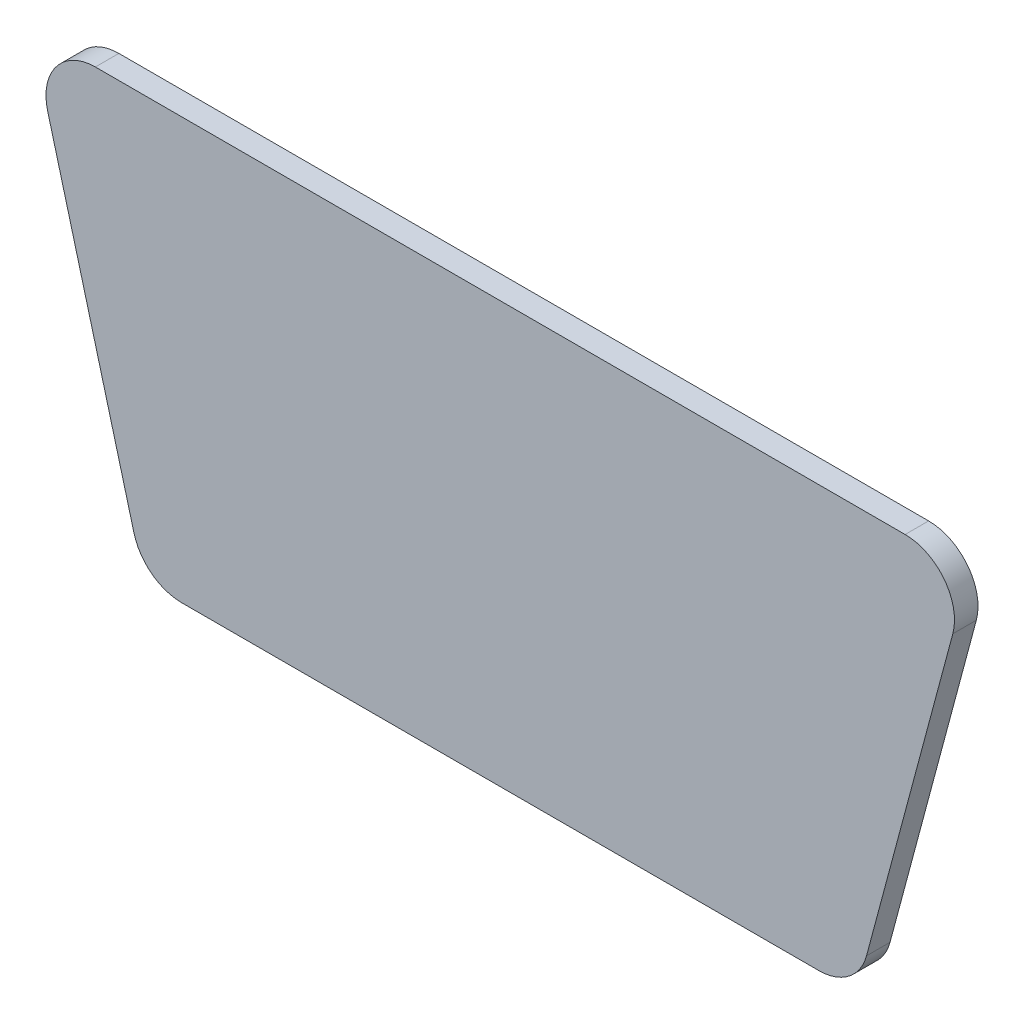
ISO-10303-21;
HEADER;
FILE_DESCRIPTION(('STEP AP214'),'2;1');
FILE_NAME('part.step','',(''),(''),'','','');
FILE_SCHEMA(('AUTOMOTIVE_DESIGN { 1 0 10303 214 1 1 1 1 }'));
ENDSEC;
DATA;
#1=APPLICATION_CONTEXT('core data for automotive mechanical design processes');
#2=APPLICATION_PROTOCOL_DEFINITION('international standard','automotive_design',2000,#1);
#3=PRODUCT_CONTEXT('',#1,'mechanical');
#4=PRODUCT('Part','Part','',(#3));
#5=PRODUCT_RELATED_PRODUCT_CATEGORY('part','',(#4));
#6=PRODUCT_DEFINITION_FORMATION('','',#4);
#7=PRODUCT_DEFINITION_CONTEXT('part definition',#1,'design');
#8=PRODUCT_DEFINITION('design','',#6,#7);
#9=PRODUCT_DEFINITION_SHAPE('','',#8);
#10=(LENGTH_UNIT() NAMED_UNIT(*) SI_UNIT(.MILLI.,.METRE.));
#11=(NAMED_UNIT(*) PLANE_ANGLE_UNIT() SI_UNIT($,.RADIAN.));
#12=(NAMED_UNIT(*) SI_UNIT($,.STERADIAN.) SOLID_ANGLE_UNIT());
#13=UNCERTAINTY_MEASURE_WITH_UNIT(LENGTH_MEASURE(1.E-05),#10,'distance_accuracy_value','');
#14=(GEOMETRIC_REPRESENTATION_CONTEXT(3) GLOBAL_UNCERTAINTY_ASSIGNED_CONTEXT((#13)) GLOBAL_UNIT_ASSIGNED_CONTEXT((#10,
#11,#12)) REPRESENTATION_CONTEXT('',''));
#15=CARTESIAN_POINT('',(0.,0.,0.));
#16=DIRECTION('',(0.,0.,1.));
#17=DIRECTION('',(1.,0.,0.));
#18=AXIS2_PLACEMENT_3D('',#15,#16,#17);
#19=CARTESIAN_POINT('',(-8.6110075984364,3.425,0.5));
#20=DIRECTION('',(0.,0.,-1.));
#21=DIRECTION('',(-1.,0.,0.));
#22=AXIS2_PLACEMENT_3D('',#19,#20,#21);
#23=CYLINDRICAL_SURFACE('',#22,1.05);
#24=CARTESIAN_POINT('',(-8.6110075984364,3.425,0.));
#25=DIRECTION('',(0.,0.,-1.));
#26=DIRECTION('',(-1.,0.,0.));
#27=AXIS2_PLACEMENT_3D('',#24,#25,#26);
#28=CIRCLE('',#27,1.05);
#29=CARTESIAN_POINT('',(-9.62522971603992,3.15324000264235,0.));
#30=VERTEX_POINT('',#29);
#31=CARTESIAN_POINT('',(-8.6110075984364,4.475,0.));
#32=VERTEX_POINT('',#31);
#33=EDGE_CURVE('E132',#30,#32,#28,.T.);
#34=ORIENTED_EDGE('',*,*,#33,.F.);
#35=DIRECTION('',(0.,0.,-1.));
#36=VECTOR('',#35,1.);
#37=CARTESIAN_POINT('',(-9.62522971603992,3.15324000264235,0.5));
#38=LINE('',#37,#36);
#39=CARTESIAN_POINT('',(-9.62522971603992,3.15324000264235,0.5));
#40=VERTEX_POINT('',#39);
#41=EDGE_CURVE('E11',#40,#30,#38,.T.);
#42=ORIENTED_EDGE('',*,*,#41,.F.);
#43=CARTESIAN_POINT('',(-8.6110075984364,3.425,0.5));
#44=DIRECTION('',(0.,0.,-1.));
#45=DIRECTION('',(-1.,0.,0.));
#46=AXIS2_PLACEMENT_3D('',#43,#44,#45);
#47=CIRCLE('',#46,1.05);
#48=CARTESIAN_POINT('',(-8.6110075984364,4.475,0.5));
#49=VERTEX_POINT('',#48);
#50=EDGE_CURVE('E150',#40,#49,#47,.T.);
#51=ORIENTED_EDGE('',*,*,#50,.T.);
#52=DIRECTION('',(0.,0.,-1.));
#53=VECTOR('',#52,1.);
#54=CARTESIAN_POINT('',(-8.6110075984364,4.475,0.5));
#55=LINE('',#54,#53);
#56=EDGE_CURVE('E37',#49,#32,#55,.T.);
#57=ORIENTED_EDGE('',*,*,#56,.T.);
#58=EDGE_LOOP('',(#34,#42,#51,#57));
#59=FACE_BOUND('',#58,.T.);
#60=ADVANCED_FACE('F34',(#59),#23,.T.);
#61=CARTESIAN_POINT('',(-9.62522971603992,3.15324000264235,0.5));
#62=DIRECTION('',(0.965925826289068,0.258819045102522,0.));
#63=DIRECTION('',(-0.258819045102522,0.965925826289068,0.));
#64=AXIS2_PLACEMENT_3D('',#61,#62,#63);
#65=PLANE('',#64);
#66=DIRECTION('',(0.258819045102522,-0.965925826289068,0.));
#67=VECTOR('',#66,1.);
#68=CARTESIAN_POINT('',(-9.62522971603992,3.15324000264235,0.));
#69=LINE('',#68,#67);
#70=CARTESIAN_POINT('',(-7.78977774788672,-3.69675999735765,0.));
#71=VERTEX_POINT('',#70);
#72=EDGE_CURVE('E79',#30,#71,#69,.T.);
#73=ORIENTED_EDGE('',*,*,#72,.T.);
#74=DIRECTION('',(0.,0.,-1.));
#75=VECTOR('',#74,1.);
#76=CARTESIAN_POINT('',(-7.78977774788672,-3.69675999735765,0.5));
#77=LINE('',#76,#75);
#78=CARTESIAN_POINT('',(-7.78977774788672,-3.69675999735765,0.5));
#79=VERTEX_POINT('',#78);
#80=EDGE_CURVE('E43',#79,#71,#77,.T.);
#81=ORIENTED_EDGE('',*,*,#80,.F.);
#82=DIRECTION('',(0.258819045102522,-0.965925826289068,0.));
#83=VECTOR('',#82,1.);
#84=CARTESIAN_POINT('',(-9.62522971603992,3.15324000264235,0.5));
#85=LINE('',#84,#83);
#86=EDGE_CURVE('E110',#40,#79,#85,.T.);
#87=ORIENTED_EDGE('',*,*,#86,.F.);
#88=ORIENTED_EDGE('',*,*,#41,.T.);
#89=EDGE_LOOP('',(#73,#81,#87,#88));
#90=FACE_BOUND('',#89,.T.);
#91=ADVANCED_FACE('F188',(#90),#65,.F.);
#92=CARTESIAN_POINT('',(-6.7755556302832,-3.425,0.5));
#93=DIRECTION('',(0.,0.,-1.));
#94=DIRECTION('',(-1.,0.,0.));
#95=AXIS2_PLACEMENT_3D('',#92,#93,#94);
#96=CYLINDRICAL_SURFACE('',#95,1.05);
#97=CARTESIAN_POINT('',(-6.7755556302832,-3.425,0.));
#98=DIRECTION('',(0.,0.,1.));
#99=DIRECTION('',(1.,0.,0.));
#100=AXIS2_PLACEMENT_3D('',#97,#98,#99);
#101=CIRCLE('',#100,1.05);
#102=CARTESIAN_POINT('',(-6.7755556302832,-4.475,0.));
#103=VERTEX_POINT('',#102);
#104=EDGE_CURVE('E117',#71,#103,#101,.T.);
#105=ORIENTED_EDGE('',*,*,#104,.T.);
#106=DIRECTION('',(0.,0.,-1.));
#107=VECTOR('',#106,1.);
#108=CARTESIAN_POINT('',(-6.7755556302832,-4.475,0.5));
#109=LINE('',#108,#107);
#110=CARTESIAN_POINT('',(-6.7755556302832,-4.475,0.5));
#111=VERTEX_POINT('',#110);
#112=EDGE_CURVE('E114',#111,#103,#109,.T.);
#113=ORIENTED_EDGE('',*,*,#112,.F.);
#114=CARTESIAN_POINT('',(-6.7755556302832,-3.425,0.5));
#115=DIRECTION('',(0.,0.,1.));
#116=DIRECTION('',(1.,0.,0.));
#117=AXIS2_PLACEMENT_3D('',#114,#115,#116);
#118=CIRCLE('',#117,1.05);
#119=EDGE_CURVE('E103',#79,#111,#118,.T.);
#120=ORIENTED_EDGE('',*,*,#119,.F.);
#121=ORIENTED_EDGE('',*,*,#80,.T.);
#122=EDGE_LOOP('',(#105,#113,#120,#121));
#123=FACE_BOUND('',#122,.T.);
#124=ADVANCED_FACE('F115',(#123),#96,.T.);
#125=CARTESIAN_POINT('',(-6.7755556302832,-4.475,0.5));
#126=DIRECTION('',(0.,1.,0.));
#127=DIRECTION('',(0.,0.,1.));
#128=AXIS2_PLACEMENT_3D('',#125,#126,#127);
#129=PLANE('',#128);
#130=DIRECTION('',(1.,0.,0.));
#131=VECTOR('',#130,1.);
#132=CARTESIAN_POINT('',(-6.7755556302832,-4.475,0.));
#133=LINE('',#132,#131);
#134=CARTESIAN_POINT('',(6.7755556302832,-4.475,0.));
#135=VERTEX_POINT('',#134);
#136=EDGE_CURVE('E147',#103,#135,#133,.T.);
#137=ORIENTED_EDGE('',*,*,#136,.T.);
#138=DIRECTION('',(0.,0.,-1.));
#139=VECTOR('',#138,1.);
#140=CARTESIAN_POINT('',(6.7755556302832,-4.475,0.5));
#141=LINE('',#140,#139);
#142=CARTESIAN_POINT('',(6.7755556302832,-4.475,0.5));
#143=VERTEX_POINT('',#142);
#144=EDGE_CURVE('E120',#143,#135,#141,.T.);
#145=ORIENTED_EDGE('',*,*,#144,.F.);
#146=DIRECTION('',(1.,0.,0.));
#147=VECTOR('',#146,1.);
#148=CARTESIAN_POINT('',(-6.7755556302832,-4.475,0.5));
#149=LINE('',#148,#147);
#150=EDGE_CURVE('E108',#111,#143,#149,.T.);
#151=ORIENTED_EDGE('',*,*,#150,.F.);
#152=ORIENTED_EDGE('',*,*,#112,.T.);
#153=EDGE_LOOP('',(#137,#145,#151,#152));
#154=FACE_BOUND('',#153,.T.);
#155=ADVANCED_FACE('F122',(#154),#129,.F.);
#156=CARTESIAN_POINT('',(6.7755556302832,-3.425,0.5));
#157=DIRECTION('',(0.,0.,-1.));
#158=DIRECTION('',(-1.,0.,0.));
#159=AXIS2_PLACEMENT_3D('',#156,#157,#158);
#160=CYLINDRICAL_SURFACE('',#159,1.05);
#161=CARTESIAN_POINT('',(6.7755556302832,-3.425,0.));
#162=DIRECTION('',(0.,0.,1.));
#163=DIRECTION('',(1.,0.,0.));
#164=AXIS2_PLACEMENT_3D('',#161,#162,#163);
#165=CIRCLE('',#164,1.05);
#166=CARTESIAN_POINT('',(7.78977774788672,-3.69675999735765,0.));
#167=VERTEX_POINT('',#166);
#168=EDGE_CURVE('E144',#135,#167,#165,.T.);
#169=ORIENTED_EDGE('',*,*,#168,.T.);
#170=DIRECTION('',(0.,0.,-1.));
#171=VECTOR('',#170,1.);
#172=CARTESIAN_POINT('',(7.78977774788672,-3.69675999735765,0.5));
#173=LINE('',#172,#171);
#174=CARTESIAN_POINT('',(7.78977774788672,-3.69675999735765,0.5));
#175=VERTEX_POINT('',#174);
#176=EDGE_CURVE('E154',#175,#167,#173,.T.);
#177=ORIENTED_EDGE('',*,*,#176,.F.);
#178=CARTESIAN_POINT('',(6.7755556302832,-3.425,0.5));
#179=DIRECTION('',(0.,0.,1.));
#180=DIRECTION('',(1.,0.,0.));
#181=AXIS2_PLACEMENT_3D('',#178,#179,#180);
#182=CIRCLE('',#181,1.05);
#183=EDGE_CURVE('E125',#143,#175,#182,.T.);
#184=ORIENTED_EDGE('',*,*,#183,.F.);
#185=ORIENTED_EDGE('',*,*,#144,.T.);
#186=EDGE_LOOP('',(#169,#177,#184,#185));
#187=FACE_BOUND('',#186,.T.);
#188=ADVANCED_FACE('F165',(#187),#160,.T.);
#189=CARTESIAN_POINT('',(9.62522971603993,3.15324000264236,0.5));
#190=DIRECTION('',(0.965925826289067,-0.258819045102524,0.));
#191=DIRECTION('',(0.258819045102524,0.965925826289068,0.));
#192=AXIS2_PLACEMENT_3D('',#189,#190,#191);
#193=PLANE('',#192);
#194=DIRECTION('',(-0.258819045102524,-0.965925826289067,0.));
#195=VECTOR('',#194,1.);
#196=CARTESIAN_POINT('',(9.62522971603993,3.15324000264236,0.));
#197=LINE('',#196,#195);
#198=CARTESIAN_POINT('',(9.62522971603993,3.15324000264236,0.));
#199=VERTEX_POINT('',#198);
#200=EDGE_CURVE('E141',#199,#167,#197,.T.);
#201=ORIENTED_EDGE('',*,*,#200,.F.);
#202=DIRECTION('',(0.,0.,-1.));
#203=VECTOR('',#202,1.);
#204=CARTESIAN_POINT('',(9.62522971603993,3.15324000264236,0.5));
#205=LINE('',#204,#203);
#206=CARTESIAN_POINT('',(9.62522971603993,3.15324000264236,0.5));
#207=VERTEX_POINT('',#206);
#208=EDGE_CURVE('E156',#207,#199,#205,.T.);
#209=ORIENTED_EDGE('',*,*,#208,.F.);
#210=DIRECTION('',(-0.258819045102524,-0.965925826289067,0.));
#211=VECTOR('',#210,1.);
#212=CARTESIAN_POINT('',(9.62522971603993,3.15324000264236,0.5));
#213=LINE('',#212,#211);
#214=EDGE_CURVE('E127',#207,#175,#213,.T.);
#215=ORIENTED_EDGE('',*,*,#214,.T.);
#216=ORIENTED_EDGE('',*,*,#176,.T.);
#217=EDGE_LOOP('',(#201,#209,#215,#216));
#218=FACE_BOUND('',#217,.T.);
#219=ADVANCED_FACE('F177',(#218),#193,.T.);
#220=CARTESIAN_POINT('',(8.61100759843642,3.425,0.5));
#221=DIRECTION('',(0.,0.,-1.));
#222=DIRECTION('',(-1.,0.,0.));
#223=AXIS2_PLACEMENT_3D('',#220,#221,#222);
#224=CYLINDRICAL_SURFACE('',#223,1.04999999999999);
#225=CARTESIAN_POINT('',(8.61100759843642,3.425,0.));
#226=DIRECTION('',(0.,0.,1.));
#227=DIRECTION('',(1.,0.,0.));
#228=AXIS2_PLACEMENT_3D('',#225,#226,#227);
#229=CIRCLE('',#228,1.04999999999999);
#230=CARTESIAN_POINT('',(8.61100759843642,4.47499999999999,0.));
#231=VERTEX_POINT('',#230);
#232=EDGE_CURVE('E138',#199,#231,#229,.T.);
#233=ORIENTED_EDGE('',*,*,#232,.T.);
#234=DIRECTION('',(0.,0.,-1.));
#235=VECTOR('',#234,1.);
#236=CARTESIAN_POINT('',(8.61100759843642,4.47499999999999,0.5));
#237=LINE('',#236,#235);
#238=CARTESIAN_POINT('',(8.61100759843642,4.47499999999999,0.5));
#239=VERTEX_POINT('',#238);
#240=EDGE_CURVE('E157',#239,#231,#237,.T.);
#241=ORIENTED_EDGE('',*,*,#240,.F.);
#242=CARTESIAN_POINT('',(8.61100759843642,3.425,0.5));
#243=DIRECTION('',(0.,0.,1.));
#244=DIRECTION('',(1.,0.,0.));
#245=AXIS2_PLACEMENT_3D('',#242,#243,#244);
#246=CIRCLE('',#245,1.04999999999999);
#247=EDGE_CURVE('E170',#207,#239,#246,.T.);
#248=ORIENTED_EDGE('',*,*,#247,.F.);
#249=ORIENTED_EDGE('',*,*,#208,.T.);
#250=EDGE_LOOP('',(#233,#241,#248,#249));
#251=FACE_BOUND('',#250,.T.);
#252=ADVANCED_FACE('F179',(#251),#224,.T.);
#253=CARTESIAN_POINT('',(-8.6110075984364,4.475,0.5));
#254=DIRECTION('',(0.,1.,0.));
#255=DIRECTION('',(0.,0.,1.));
#256=AXIS2_PLACEMENT_3D('',#253,#254,#255);
#257=PLANE('',#256);
#258=DIRECTION('',(1.,0.,0.));
#259=VECTOR('',#258,1.);
#260=CARTESIAN_POINT('',(-8.6110075984364,4.475,0.));
#261=LINE('',#260,#259);
#262=EDGE_CURVE('E135',#32,#231,#261,.T.);
#263=ORIENTED_EDGE('',*,*,#262,.F.);
#264=ORIENTED_EDGE('',*,*,#56,.F.);
#265=DIRECTION('',(1.,0.,0.));
#266=VECTOR('',#265,1.);
#267=CARTESIAN_POINT('',(-8.6110075984364,4.475,0.5));
#268=LINE('',#267,#266);
#269=EDGE_CURVE('E172',#49,#239,#268,.T.);
#270=ORIENTED_EDGE('',*,*,#269,.T.);
#271=ORIENTED_EDGE('',*,*,#240,.T.);
#272=EDGE_LOOP('',(#263,#264,#270,#271));
#273=FACE_BOUND('',#272,.T.);
#274=ADVANCED_FACE('F159',(#273),#257,.T.);
#275=CARTESIAN_POINT('',(-8.6110075984364,3.425,0.5));
#276=DIRECTION('',(0.,0.,-1.));
#277=DIRECTION('',(-1.,0.,0.));
#278=AXIS2_PLACEMENT_3D('',#275,#276,#277);
#279=PLANE('',#278);
#280=ORIENTED_EDGE('',*,*,#50,.F.);
#281=ORIENTED_EDGE('',*,*,#86,.T.);
#282=ORIENTED_EDGE('',*,*,#119,.T.);
#283=ORIENTED_EDGE('',*,*,#150,.T.);
#284=ORIENTED_EDGE('',*,*,#183,.T.);
#285=ORIENTED_EDGE('',*,*,#214,.F.);
#286=ORIENTED_EDGE('',*,*,#247,.T.);
#287=ORIENTED_EDGE('',*,*,#269,.F.);
#288=EDGE_LOOP('',(#280,#281,#282,#283,#284,#285,#286,#287));
#289=FACE_BOUND('',#288,.T.);
#290=ADVANCED_FACE('F106',(#289),#279,.F.);
#291=CARTESIAN_POINT('',(-8.6110075984364,3.425,0.));
#292=DIRECTION('',(0.,0.,-1.));
#293=DIRECTION('',(-1.,0.,0.));
#294=AXIS2_PLACEMENT_3D('',#291,#292,#293);
#295=PLANE('',#294);
#296=ORIENTED_EDGE('',*,*,#33,.T.);
#297=ORIENTED_EDGE('',*,*,#262,.T.);
#298=ORIENTED_EDGE('',*,*,#232,.F.);
#299=ORIENTED_EDGE('',*,*,#200,.T.);
#300=ORIENTED_EDGE('',*,*,#168,.F.);
#301=ORIENTED_EDGE('',*,*,#136,.F.);
#302=ORIENTED_EDGE('',*,*,#104,.F.);
#303=ORIENTED_EDGE('',*,*,#72,.F.);
#304=EDGE_LOOP('',(#296,#297,#298,#299,#300,#301,#302,#303));
#305=FACE_BOUND('',#304,.T.);
#306=ADVANCED_FACE('F162',(#305),#295,.T.);
#307=CLOSED_SHELL('',(#60,#91,#124,#155,#188,#219,#252,#274,#290,#306));
#308=MANIFOLD_SOLID_BREP('B2',#307);
#309=ADVANCED_BREP_SHAPE_REPRESENTATION('',(#18,#308),#14);
#310=SHAPE_DEFINITION_REPRESENTATION(#9,#309);
ENDSEC;
END-ISO-10303-21;
